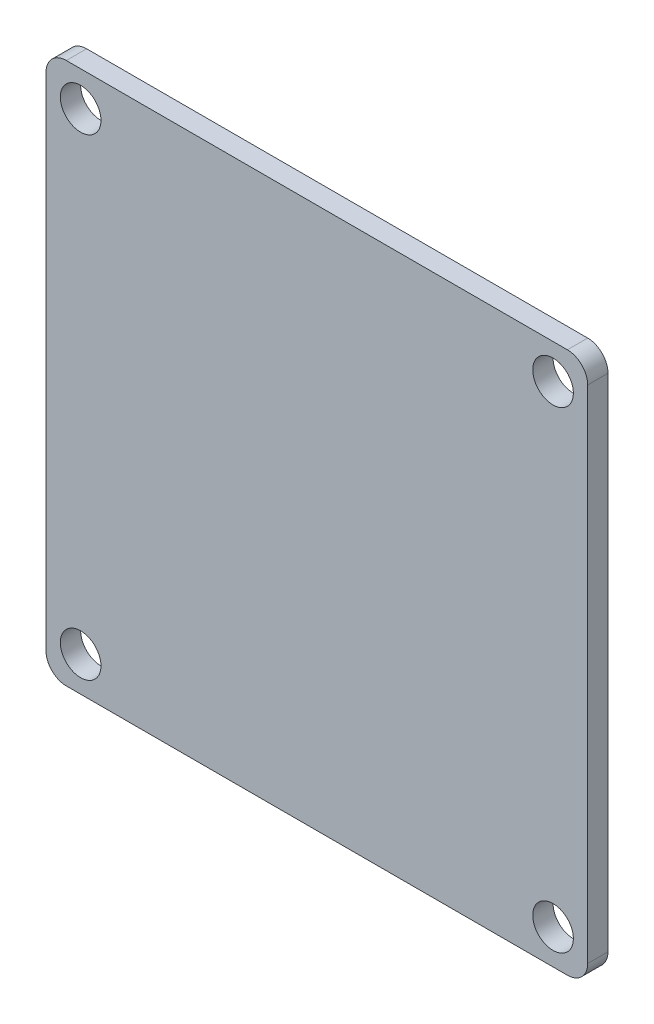
ISO-10303-21;
HEADER;
FILE_DESCRIPTION(('STEP AP214'),'2;1');
FILE_NAME('part.step','',(''),(''),'','','');
FILE_SCHEMA(('AUTOMOTIVE_DESIGN { 1 0 10303 214 1 1 1 1 }'));
ENDSEC;
DATA;
#1=APPLICATION_CONTEXT('core data for automotive mechanical design processes');
#2=APPLICATION_PROTOCOL_DEFINITION('international standard','automotive_design',2000,#1);
#3=PRODUCT_CONTEXT('',#1,'mechanical');
#4=PRODUCT('Part','Part','',(#3));
#5=PRODUCT_RELATED_PRODUCT_CATEGORY('part','',(#4));
#6=PRODUCT_DEFINITION_FORMATION('','',#4);
#7=PRODUCT_DEFINITION_CONTEXT('part definition',#1,'design');
#8=PRODUCT_DEFINITION('design','',#6,#7);
#9=PRODUCT_DEFINITION_SHAPE('','',#8);
#10=(LENGTH_UNIT() NAMED_UNIT(*) SI_UNIT(.MILLI.,.METRE.));
#11=(NAMED_UNIT(*) PLANE_ANGLE_UNIT() SI_UNIT($,.RADIAN.));
#12=(NAMED_UNIT(*) SI_UNIT($,.STERADIAN.) SOLID_ANGLE_UNIT());
#13=UNCERTAINTY_MEASURE_WITH_UNIT(LENGTH_MEASURE(1.E-05),#10,'distance_accuracy_value','');
#14=(GEOMETRIC_REPRESENTATION_CONTEXT(3) GLOBAL_UNCERTAINTY_ASSIGNED_CONTEXT((#13)) GLOBAL_UNIT_ASSIGNED_CONTEXT((#10,
#11,#12)) REPRESENTATION_CONTEXT('',''));
#15=CARTESIAN_POINT('',(0.,0.,0.));
#16=DIRECTION('',(0.,0.,1.));
#17=DIRECTION('',(1.,0.,0.));
#18=AXIS2_PLACEMENT_3D('',#15,#16,#17);
#19=CARTESIAN_POINT('',(-18.5,-18.5,1.5));
#20=DIRECTION('',(0.,0.,-1.));
#21=DIRECTION('',(-1.,0.,0.));
#22=AXIS2_PLACEMENT_3D('',#19,#20,#21);
#23=PLANE('',#22);
#24=CARTESIAN_POINT('',(-18.5,-18.5,1.5));
#25=DIRECTION('',(0.,0.,1.));
#26=DIRECTION('',(-1.,0.,0.));
#27=AXIS2_PLACEMENT_3D('',#24,#25,#26);
#28=CIRCLE('',#27,1.5);
#29=CARTESIAN_POINT('',(-20.,-18.5,1.5));
#30=VERTEX_POINT('',#29);
#31=CARTESIAN_POINT('',(-18.5,-20.,1.5));
#32=VERTEX_POINT('',#31);
#33=EDGE_CURVE('E145',#30,#32,#28,.T.);
#34=ORIENTED_EDGE('',*,*,#33,.T.);
#35=DIRECTION('',(1.,0.,0.));
#36=VECTOR('',#35,1.);
#37=CARTESIAN_POINT('',(-18.5,-20.,1.5));
#38=LINE('',#37,#36);
#39=CARTESIAN_POINT('',(18.5,-20.,1.5));
#40=VERTEX_POINT('',#39);
#41=EDGE_CURVE('E93',#32,#40,#38,.T.);
#42=ORIENTED_EDGE('',*,*,#41,.T.);
#43=CARTESIAN_POINT('',(18.5,-18.5,1.5));
#44=DIRECTION('',(0.,0.,1.));
#45=DIRECTION('',(1.,0.,0.));
#46=AXIS2_PLACEMENT_3D('',#43,#44,#45);
#47=CIRCLE('',#46,1.5);
#48=CARTESIAN_POINT('',(20.,-18.5,1.5));
#49=VERTEX_POINT('',#48);
#50=EDGE_CURVE('E160',#40,#49,#47,.T.);
#51=ORIENTED_EDGE('',*,*,#50,.T.);
#52=DIRECTION('',(0.,1.,0.));
#53=VECTOR('',#52,1.);
#54=CARTESIAN_POINT('',(20.,-18.5,1.5));
#55=LINE('',#54,#53);
#56=CARTESIAN_POINT('',(20.,18.5,1.5));
#57=VERTEX_POINT('',#56);
#58=EDGE_CURVE('E173',#49,#57,#55,.T.);
#59=ORIENTED_EDGE('',*,*,#58,.T.);
#60=CARTESIAN_POINT('',(18.5,18.5,1.5));
#61=DIRECTION('',(0.,0.,1.));
#62=DIRECTION('',(1.,0.,0.));
#63=AXIS2_PLACEMENT_3D('',#60,#61,#62);
#64=CIRCLE('',#63,1.5);
#65=CARTESIAN_POINT('',(18.5,20.,1.5));
#66=VERTEX_POINT('',#65);
#67=EDGE_CURVE('E112',#57,#66,#64,.T.);
#68=ORIENTED_EDGE('',*,*,#67,.T.);
#69=DIRECTION('',(-1.,0.,0.));
#70=VECTOR('',#69,1.);
#71=CARTESIAN_POINT('',(-18.5,20.,1.5));
#72=LINE('',#71,#70);
#73=CARTESIAN_POINT('',(-18.5,20.,1.5));
#74=VERTEX_POINT('',#73);
#75=EDGE_CURVE('E106',#66,#74,#72,.T.);
#76=ORIENTED_EDGE('',*,*,#75,.T.);
#77=CARTESIAN_POINT('',(-18.5,18.5,1.5));
#78=DIRECTION('',(0.,0.,1.));
#79=DIRECTION('',(-1.,0.,0.));
#80=AXIS2_PLACEMENT_3D('',#77,#78,#79);
#81=CIRCLE('',#80,1.5);
#82=CARTESIAN_POINT('',(-20.,18.5,1.5));
#83=VERTEX_POINT('',#82);
#84=EDGE_CURVE('E110',#74,#83,#81,.T.);
#85=ORIENTED_EDGE('',*,*,#84,.T.);
#86=DIRECTION('',(0.,-1.,0.));
#87=VECTOR('',#86,1.);
#88=CARTESIAN_POINT('',(-20.,-18.5,1.5));
#89=LINE('',#88,#87);
#90=EDGE_CURVE('E50',#83,#30,#89,.T.);
#91=ORIENTED_EDGE('',*,*,#90,.T.);
#92=EDGE_LOOP('',(#34,#42,#51,#59,#68,#76,#85,#91));
#93=FACE_BOUND('',#92,.T.);
#94=CARTESIAN_POINT('',(-17.4424312761678,17.4424312761678,1.5));
#95=DIRECTION('',(0.,0.,1.));
#96=DIRECTION('',(1.,0.,0.));
#97=AXIS2_PLACEMENT_3D('',#94,#95,#96);
#98=CIRCLE('',#97,1.5);
#99=CARTESIAN_POINT('',(-15.9424312761678,17.4424312761678,1.5));
#100=VERTEX_POINT('',#99);
#101=EDGE_CURVE('E134',#100,#100,#98,.T.);
#102=ORIENTED_EDGE('',*,*,#101,.F.);
#103=EDGE_LOOP('',(#102));
#104=FACE_BOUND('',#103,.T.);
#105=CARTESIAN_POINT('',(17.4424312761678,17.4424312761688,1.5));
#106=DIRECTION('',(0.,0.,1.));
#107=DIRECTION('',(1.,0.,0.));
#108=AXIS2_PLACEMENT_3D('',#105,#106,#107);
#109=CIRCLE('',#108,1.50000000000101);
#110=CARTESIAN_POINT('',(18.9424312761688,17.4424312761688,1.5));
#111=VERTEX_POINT('',#110);
#112=EDGE_CURVE('E182',#111,#111,#109,.T.);
#113=ORIENTED_EDGE('',*,*,#112,.F.);
#114=EDGE_LOOP('',(#113));
#115=FACE_BOUND('',#114,.T.);
#116=CARTESIAN_POINT('',(17.4424312761688,-17.4424312761668,1.5));
#117=DIRECTION('',(0.,0.,1.));
#118=DIRECTION('',(1.,0.,0.));
#119=AXIS2_PLACEMENT_3D('',#116,#117,#118);
#120=CIRCLE('',#119,1.50000000000137);
#121=CARTESIAN_POINT('',(18.9424312761702,-17.4424312761668,1.5));
#122=VERTEX_POINT('',#121);
#123=EDGE_CURVE('E188',#122,#122,#120,.T.);
#124=ORIENTED_EDGE('',*,*,#123,.F.);
#125=EDGE_LOOP('',(#124));
#126=FACE_BOUND('',#125,.T.);
#127=CARTESIAN_POINT('',(-17.4424312761668,-17.4424312761678,1.5));
#128=DIRECTION('',(0.,0.,1.));
#129=DIRECTION('',(1.,0.,0.));
#130=AXIS2_PLACEMENT_3D('',#127,#128,#129);
#131=CIRCLE('',#130,1.50000000000052);
#132=CARTESIAN_POINT('',(-15.9424312761663,-17.4424312761678,1.5));
#133=VERTEX_POINT('',#132);
#134=EDGE_CURVE('E194',#133,#133,#131,.T.);
#135=ORIENTED_EDGE('',*,*,#134,.F.);
#136=EDGE_LOOP('',(#135));
#137=FACE_BOUND('',#136,.T.);
#138=ADVANCED_FACE('F33',(#93,#104,#115,#126,#137),#23,.F.);
#139=CARTESIAN_POINT('',(-18.5,-18.5,0.));
#140=DIRECTION('',(0.,0.,-1.));
#141=DIRECTION('',(-1.,0.,0.));
#142=AXIS2_PLACEMENT_3D('',#139,#140,#141);
#143=PLANE('',#142);
#144=CARTESIAN_POINT('',(17.4424312761688,-17.4424312761668,0.));
#145=DIRECTION('',(0.,0.,1.));
#146=DIRECTION('',(1.,0.,0.));
#147=AXIS2_PLACEMENT_3D('',#144,#145,#146);
#148=CIRCLE('',#147,1.50000000000137);
#149=CARTESIAN_POINT('',(18.9424312761702,-17.4424312761668,0.));
#150=VERTEX_POINT('',#149);
#151=EDGE_CURVE('E191',#150,#150,#148,.T.);
#152=ORIENTED_EDGE('',*,*,#151,.T.);
#153=EDGE_LOOP('',(#152));
#154=FACE_BOUND('',#153,.T.);
#155=CARTESIAN_POINT('',(-17.4424312761678,17.4424312761678,0.));
#156=DIRECTION('',(0.,0.,1.));
#157=DIRECTION('',(1.,0.,0.));
#158=AXIS2_PLACEMENT_3D('',#155,#156,#157);
#159=CIRCLE('',#158,1.5);
#160=CARTESIAN_POINT('',(-15.9424312761678,17.4424312761678,0.));
#161=VERTEX_POINT('',#160);
#162=EDGE_CURVE('E179',#161,#161,#159,.T.);
#163=ORIENTED_EDGE('',*,*,#162,.T.);
#164=EDGE_LOOP('',(#163));
#165=FACE_BOUND('',#164,.T.);
#166=CARTESIAN_POINT('',(-18.5,-18.5,0.));
#167=DIRECTION('',(0.,0.,1.));
#168=DIRECTION('',(-1.,0.,0.));
#169=AXIS2_PLACEMENT_3D('',#166,#167,#168);
#170=CIRCLE('',#169,1.5);
#171=CARTESIAN_POINT('',(-20.,-18.5,0.));
#172=VERTEX_POINT('',#171);
#173=CARTESIAN_POINT('',(-18.5,-20.,0.));
#174=VERTEX_POINT('',#173);
#175=EDGE_CURVE('E130',#172,#174,#170,.T.);
#176=ORIENTED_EDGE('',*,*,#175,.F.);
#177=DIRECTION('',(0.,-1.,0.));
#178=VECTOR('',#177,1.);
#179=CARTESIAN_POINT('',(-20.,-18.5,0.));
#180=LINE('',#179,#178);
#181=CARTESIAN_POINT('',(-20.,18.5,0.));
#182=VERTEX_POINT('',#181);
#183=EDGE_CURVE('E85',#182,#172,#180,.T.);
#184=ORIENTED_EDGE('',*,*,#183,.F.);
#185=CARTESIAN_POINT('',(-18.5,18.5,0.));
#186=DIRECTION('',(0.,0.,1.));
#187=DIRECTION('',(-1.,0.,0.));
#188=AXIS2_PLACEMENT_3D('',#185,#186,#187);
#189=CIRCLE('',#188,1.5);
#190=CARTESIAN_POINT('',(-18.5,20.,0.));
#191=VERTEX_POINT('',#190);
#192=EDGE_CURVE('E79',#191,#182,#189,.T.);
#193=ORIENTED_EDGE('',*,*,#192,.F.);
#194=DIRECTION('',(-1.,0.,0.));
#195=VECTOR('',#194,1.);
#196=CARTESIAN_POINT('',(-18.5,20.,0.));
#197=LINE('',#196,#195);
#198=CARTESIAN_POINT('',(18.5,20.,0.));
#199=VERTEX_POINT('',#198);
#200=EDGE_CURVE('E120',#199,#191,#197,.T.);
#201=ORIENTED_EDGE('',*,*,#200,.F.);
#202=CARTESIAN_POINT('',(18.5,18.5,0.));
#203=DIRECTION('',(0.,0.,1.));
#204=DIRECTION('',(1.,0.,0.));
#205=AXIS2_PLACEMENT_3D('',#202,#203,#204);
#206=CIRCLE('',#205,1.5);
#207=CARTESIAN_POINT('',(20.,18.5,0.));
#208=VERTEX_POINT('',#207);
#209=EDGE_CURVE('E140',#208,#199,#206,.T.);
#210=ORIENTED_EDGE('',*,*,#209,.F.);
#211=DIRECTION('',(0.,1.,0.));
#212=VECTOR('',#211,1.);
#213=CARTESIAN_POINT('',(20.,-18.5,0.));
#214=LINE('',#213,#212);
#215=CARTESIAN_POINT('',(20.,-18.5,0.));
#216=VERTEX_POINT('',#215);
#217=EDGE_CURVE('E138',#216,#208,#214,.T.);
#218=ORIENTED_EDGE('',*,*,#217,.F.);
#219=CARTESIAN_POINT('',(18.5,-18.5,0.));
#220=DIRECTION('',(0.,0.,1.));
#221=DIRECTION('',(1.,0.,0.));
#222=AXIS2_PLACEMENT_3D('',#219,#220,#221);
#223=CIRCLE('',#222,1.5);
#224=CARTESIAN_POINT('',(18.5,-20.,0.));
#225=VERTEX_POINT('',#224);
#226=EDGE_CURVE('E136',#225,#216,#223,.T.);
#227=ORIENTED_EDGE('',*,*,#226,.F.);
#228=DIRECTION('',(1.,0.,0.));
#229=VECTOR('',#228,1.);
#230=CARTESIAN_POINT('',(-18.5,-20.,0.));
#231=LINE('',#230,#229);
#232=EDGE_CURVE('E133',#174,#225,#231,.T.);
#233=ORIENTED_EDGE('',*,*,#232,.F.);
#234=EDGE_LOOP('',(#176,#184,#193,#201,#210,#218,#227,#233));
#235=FACE_BOUND('',#234,.T.);
#236=CARTESIAN_POINT('',(17.4424312761678,17.4424312761688,0.));
#237=DIRECTION('',(0.,0.,1.));
#238=DIRECTION('',(1.,0.,0.));
#239=AXIS2_PLACEMENT_3D('',#236,#237,#238);
#240=CIRCLE('',#239,1.50000000000101);
#241=CARTESIAN_POINT('',(18.9424312761688,17.4424312761688,0.));
#242=VERTEX_POINT('',#241);
#243=EDGE_CURVE('E185',#242,#242,#240,.T.);
#244=ORIENTED_EDGE('',*,*,#243,.T.);
#245=EDGE_LOOP('',(#244));
#246=FACE_BOUND('',#245,.T.);
#247=CARTESIAN_POINT('',(-17.4424312761668,-17.4424312761678,0.));
#248=DIRECTION('',(0.,0.,1.));
#249=DIRECTION('',(1.,0.,0.));
#250=AXIS2_PLACEMENT_3D('',#247,#248,#249);
#251=CIRCLE('',#250,1.50000000000052);
#252=CARTESIAN_POINT('',(-15.9424312761663,-17.4424312761678,0.));
#253=VERTEX_POINT('',#252);
#254=EDGE_CURVE('E197',#253,#253,#251,.T.);
#255=ORIENTED_EDGE('',*,*,#254,.T.);
#256=EDGE_LOOP('',(#255));
#257=FACE_BOUND('',#256,.T.);
#258=ADVANCED_FACE('F164',(#154,#165,#235,#246,#257),#143,.T.);
#259=CARTESIAN_POINT('',(-18.5,-18.5,1.5));
#260=DIRECTION('',(0.,0.,-1.));
#261=DIRECTION('',(-1.,0.,0.));
#262=AXIS2_PLACEMENT_3D('',#259,#260,#261);
#263=CYLINDRICAL_SURFACE('',#262,1.5);
#264=ORIENTED_EDGE('',*,*,#175,.T.);
#265=DIRECTION('',(0.,0.,-1.));
#266=VECTOR('',#265,1.);
#267=CARTESIAN_POINT('',(-18.5,-20.,1.5));
#268=LINE('',#267,#266);
#269=EDGE_CURVE('E11',#32,#174,#268,.T.);
#270=ORIENTED_EDGE('',*,*,#269,.F.);
#271=ORIENTED_EDGE('',*,*,#33,.F.);
#272=DIRECTION('',(0.,0.,-1.));
#273=VECTOR('',#272,1.);
#274=CARTESIAN_POINT('',(-20.,-18.5,1.5));
#275=LINE('',#274,#273);
#276=EDGE_CURVE('E126',#30,#172,#275,.T.);
#277=ORIENTED_EDGE('',*,*,#276,.T.);
#278=EDGE_LOOP('',(#264,#270,#271,#277));
#279=FACE_BOUND('',#278,.T.);
#280=ADVANCED_FACE('F35',(#279),#263,.T.);
#281=CARTESIAN_POINT('',(-18.5,-20.,1.5));
#282=DIRECTION('',(0.,1.,0.));
#283=DIRECTION('',(0.,0.,1.));
#284=AXIS2_PLACEMENT_3D('',#281,#282,#283);
#285=PLANE('',#284);
#286=ORIENTED_EDGE('',*,*,#232,.T.);
#287=DIRECTION('',(0.,0.,-1.));
#288=VECTOR('',#287,1.);
#289=CARTESIAN_POINT('',(18.5,-20.,1.5));
#290=LINE('',#289,#288);
#291=EDGE_CURVE('E42',#40,#225,#290,.T.);
#292=ORIENTED_EDGE('',*,*,#291,.F.);
#293=ORIENTED_EDGE('',*,*,#41,.F.);
#294=ORIENTED_EDGE('',*,*,#269,.T.);
#295=EDGE_LOOP('',(#286,#292,#293,#294));
#296=FACE_BOUND('',#295,.T.);
#297=ADVANCED_FACE('F229',(#296),#285,.F.);
#298=CARTESIAN_POINT('',(18.5,-18.5,1.5));
#299=DIRECTION('',(0.,0.,-1.));
#300=DIRECTION('',(-1.,0.,0.));
#301=AXIS2_PLACEMENT_3D('',#298,#299,#300);
#302=CYLINDRICAL_SURFACE('',#301,1.5);
#303=ORIENTED_EDGE('',*,*,#226,.T.);
#304=DIRECTION('',(0.,0.,-1.));
#305=VECTOR('',#304,1.);
#306=CARTESIAN_POINT('',(20.,-18.5,1.5));
#307=LINE('',#306,#305);
#308=EDGE_CURVE('E152',#49,#216,#307,.T.);
#309=ORIENTED_EDGE('',*,*,#308,.F.);
#310=ORIENTED_EDGE('',*,*,#50,.F.);
#311=ORIENTED_EDGE('',*,*,#291,.T.);
#312=EDGE_LOOP('',(#303,#309,#310,#311));
#313=FACE_BOUND('',#312,.T.);
#314=ADVANCED_FACE('F158',(#313),#302,.T.);
#315=CARTESIAN_POINT('',(20.,-18.5,1.5));
#316=DIRECTION('',(-1.,0.,0.));
#317=DIRECTION('',(0.,0.,1.));
#318=AXIS2_PLACEMENT_3D('',#315,#316,#317);
#319=PLANE('',#318);
#320=ORIENTED_EDGE('',*,*,#217,.T.);
#321=DIRECTION('',(0.,0.,-1.));
#322=VECTOR('',#321,1.);
#323=CARTESIAN_POINT('',(20.,18.5,1.5));
#324=LINE('',#323,#322);
#325=EDGE_CURVE('E149',#57,#208,#324,.T.);
#326=ORIENTED_EDGE('',*,*,#325,.F.);
#327=ORIENTED_EDGE('',*,*,#58,.F.);
#328=ORIENTED_EDGE('',*,*,#308,.T.);
#329=EDGE_LOOP('',(#320,#326,#327,#328));
#330=FACE_BOUND('',#329,.T.);
#331=ADVANCED_FACE('F169',(#330),#319,.F.);
#332=CARTESIAN_POINT('',(18.5,18.5,1.5));
#333=DIRECTION('',(0.,0.,-1.));
#334=DIRECTION('',(-1.,0.,0.));
#335=AXIS2_PLACEMENT_3D('',#332,#333,#334);
#336=CYLINDRICAL_SURFACE('',#335,1.5);
#337=ORIENTED_EDGE('',*,*,#209,.T.);
#338=DIRECTION('',(0.,0.,-1.));
#339=VECTOR('',#338,1.);
#340=CARTESIAN_POINT('',(18.5,20.,1.5));
#341=LINE('',#340,#339);
#342=EDGE_CURVE('E121',#66,#199,#341,.T.);
#343=ORIENTED_EDGE('',*,*,#342,.F.);
#344=ORIENTED_EDGE('',*,*,#67,.F.);
#345=ORIENTED_EDGE('',*,*,#325,.T.);
#346=EDGE_LOOP('',(#337,#343,#344,#345));
#347=FACE_BOUND('',#346,.T.);
#348=ADVANCED_FACE('F172',(#347),#336,.T.);
#349=CARTESIAN_POINT('',(-18.5,20.,1.5));
#350=DIRECTION('',(0.,-1.,0.));
#351=DIRECTION('',(0.,0.,-1.));
#352=AXIS2_PLACEMENT_3D('',#349,#350,#351);
#353=PLANE('',#352);
#354=ORIENTED_EDGE('',*,*,#200,.T.);
#355=DIRECTION('',(0.,0.,-1.));
#356=VECTOR('',#355,1.);
#357=CARTESIAN_POINT('',(-18.5,20.,1.5));
#358=LINE('',#357,#356);
#359=EDGE_CURVE('E117',#74,#191,#358,.T.);
#360=ORIENTED_EDGE('',*,*,#359,.F.);
#361=ORIENTED_EDGE('',*,*,#75,.F.);
#362=ORIENTED_EDGE('',*,*,#342,.T.);
#363=EDGE_LOOP('',(#354,#360,#361,#362));
#364=FACE_BOUND('',#363,.T.);
#365=ADVANCED_FACE('F118',(#364),#353,.F.);
#366=CARTESIAN_POINT('',(-18.5,18.5,1.5));
#367=DIRECTION('',(0.,0.,-1.));
#368=DIRECTION('',(-1.,0.,0.));
#369=AXIS2_PLACEMENT_3D('',#366,#367,#368);
#370=CYLINDRICAL_SURFACE('',#369,1.5);
#371=ORIENTED_EDGE('',*,*,#192,.T.);
#372=DIRECTION('',(0.,0.,-1.));
#373=VECTOR('',#372,1.);
#374=CARTESIAN_POINT('',(-20.,18.5,1.5));
#375=LINE('',#374,#373);
#376=EDGE_CURVE('E122',#83,#182,#375,.T.);
#377=ORIENTED_EDGE('',*,*,#376,.F.);
#378=ORIENTED_EDGE('',*,*,#84,.F.);
#379=ORIENTED_EDGE('',*,*,#359,.T.);
#380=EDGE_LOOP('',(#371,#377,#378,#379));
#381=FACE_BOUND('',#380,.T.);
#382=ADVANCED_FACE('F124',(#381),#370,.T.);
#383=CARTESIAN_POINT('',(-20.,-18.5,1.5));
#384=DIRECTION('',(1.,0.,0.));
#385=DIRECTION('',(0.,0.,-1.));
#386=AXIS2_PLACEMENT_3D('',#383,#384,#385);
#387=PLANE('',#386);
#388=ORIENTED_EDGE('',*,*,#183,.T.);
#389=ORIENTED_EDGE('',*,*,#276,.F.);
#390=ORIENTED_EDGE('',*,*,#90,.F.);
#391=ORIENTED_EDGE('',*,*,#376,.T.);
#392=EDGE_LOOP('',(#388,#389,#390,#391));
#393=FACE_BOUND('',#392,.T.);
#394=ADVANCED_FACE('F217',(#393),#387,.F.);
#395=CARTESIAN_POINT('',(-17.4424312761678,17.4424312761678,1.5));
#396=DIRECTION('',(0.,0.,-1.));
#397=DIRECTION('',(-1.,0.,0.));
#398=AXIS2_PLACEMENT_3D('',#395,#396,#397);
#399=CYLINDRICAL_SURFACE('',#398,1.5);
#400=ORIENTED_EDGE('',*,*,#101,.T.);
#401=EDGE_LOOP('',(#400));
#402=FACE_BOUND('',#401,.T.);
#403=ORIENTED_EDGE('',*,*,#162,.F.);
#404=EDGE_LOOP('',(#403));
#405=FACE_BOUND('',#404,.T.);
#406=ADVANCED_FACE('F214',(#402,#405),#399,.F.);
#407=CARTESIAN_POINT('',(17.4424312761678,17.4424312761688,1.5));
#408=DIRECTION('',(0.,0.,-1.));
#409=DIRECTION('',(-1.,0.,0.));
#410=AXIS2_PLACEMENT_3D('',#407,#408,#409);
#411=CYLINDRICAL_SURFACE('',#410,1.50000000000101);
#412=ORIENTED_EDGE('',*,*,#112,.T.);
#413=EDGE_LOOP('',(#412));
#414=FACE_BOUND('',#413,.T.);
#415=ORIENTED_EDGE('',*,*,#243,.F.);
#416=EDGE_LOOP('',(#415));
#417=FACE_BOUND('',#416,.T.);
#418=ADVANCED_FACE('F293',(#414,#417),#411,.F.);
#419=CARTESIAN_POINT('',(17.4424312761688,-17.4424312761668,1.5));
#420=DIRECTION('',(0.,0.,-1.));
#421=DIRECTION('',(-1.,0.,0.));
#422=AXIS2_PLACEMENT_3D('',#419,#420,#421);
#423=CYLINDRICAL_SURFACE('',#422,1.50000000000137);
#424=ORIENTED_EDGE('',*,*,#123,.T.);
#425=EDGE_LOOP('',(#424));
#426=FACE_BOUND('',#425,.T.);
#427=ORIENTED_EDGE('',*,*,#151,.F.);
#428=EDGE_LOOP('',(#427));
#429=FACE_BOUND('',#428,.T.);
#430=ADVANCED_FACE('F301',(#426,#429),#423,.F.);
#431=CARTESIAN_POINT('',(-17.4424312761668,-17.4424312761678,1.5));
#432=DIRECTION('',(0.,0.,-1.));
#433=DIRECTION('',(-1.,0.,0.));
#434=AXIS2_PLACEMENT_3D('',#431,#432,#433);
#435=CYLINDRICAL_SURFACE('',#434,1.50000000000052);
#436=ORIENTED_EDGE('',*,*,#134,.T.);
#437=EDGE_LOOP('',(#436));
#438=FACE_BOUND('',#437,.T.);
#439=ORIENTED_EDGE('',*,*,#254,.F.);
#440=EDGE_LOOP('',(#439));
#441=FACE_BOUND('',#440,.T.);
#442=ADVANCED_FACE('F203',(#438,#441),#435,.F.);
#443=CLOSED_SHELL('',(#138,#258,#280,#297,#314,#331,#348,#365,#382,#394,#406,#418,#430,#442));
#444=MANIFOLD_SOLID_BREP('B2',#443);
#445=ADVANCED_BREP_SHAPE_REPRESENTATION('',(#18,#444),#14);
#446=SHAPE_DEFINITION_REPRESENTATION(#9,#445);
ENDSEC;
END-ISO-10303-21;
